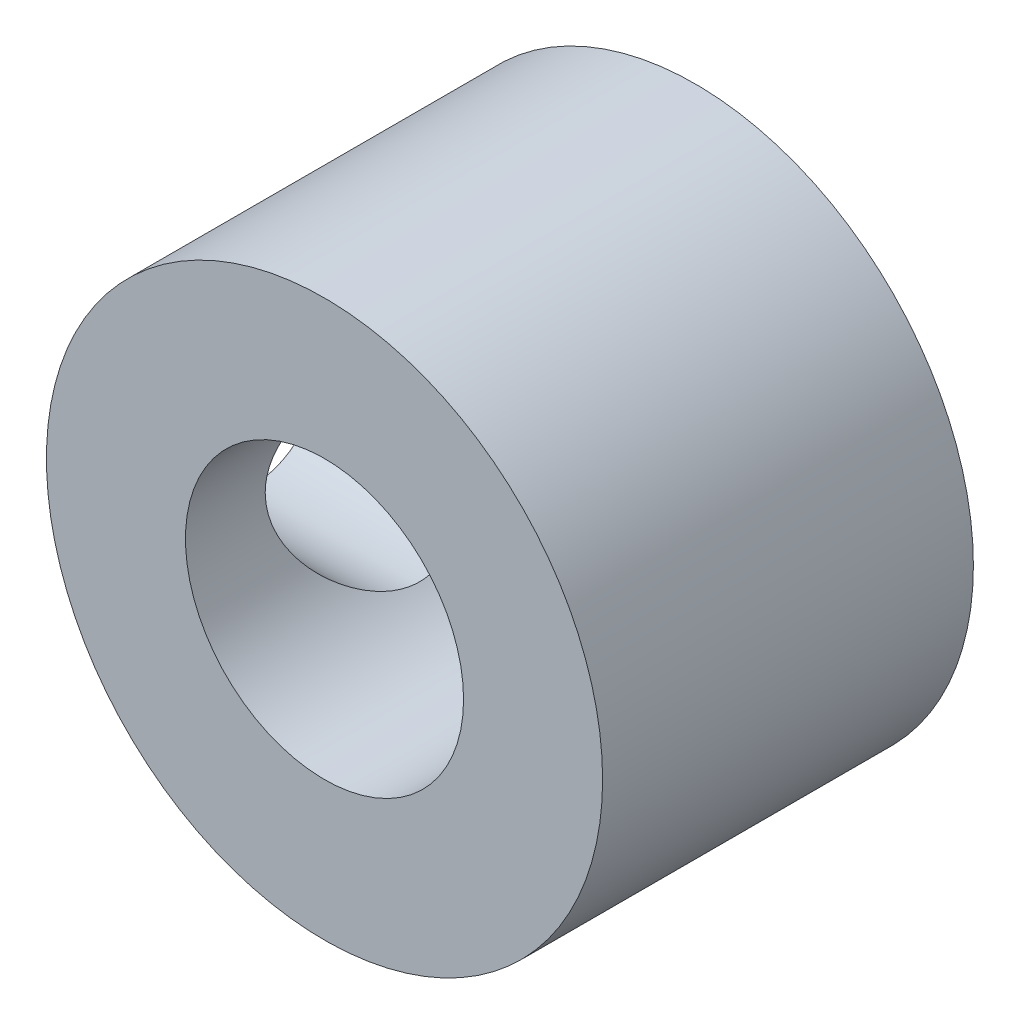
ISO-10303-21;
HEADER;
FILE_DESCRIPTION(('STEP AP214'),'2;1');
FILE_NAME('part.step','',(''),(''),'','','');
FILE_SCHEMA(('AUTOMOTIVE_DESIGN { 1 0 10303 214 1 1 1 1 }'));
ENDSEC;
DATA;
#1=APPLICATION_CONTEXT('core data for automotive mechanical design processes');
#2=APPLICATION_PROTOCOL_DEFINITION('international standard','automotive_design',2000,#1);
#3=PRODUCT_CONTEXT('',#1,'mechanical');
#4=PRODUCT('Part','Part','',(#3));
#5=PRODUCT_RELATED_PRODUCT_CATEGORY('part','',(#4));
#6=PRODUCT_DEFINITION_FORMATION('','',#4);
#7=PRODUCT_DEFINITION_CONTEXT('part definition',#1,'design');
#8=PRODUCT_DEFINITION('design','',#6,#7);
#9=PRODUCT_DEFINITION_SHAPE('','',#8);
#10=(LENGTH_UNIT() NAMED_UNIT(*) SI_UNIT(.MILLI.,.METRE.));
#11=(NAMED_UNIT(*) PLANE_ANGLE_UNIT() SI_UNIT($,.RADIAN.));
#12=(NAMED_UNIT(*) SI_UNIT($,.STERADIAN.) SOLID_ANGLE_UNIT());
#13=UNCERTAINTY_MEASURE_WITH_UNIT(LENGTH_MEASURE(1.E-05),#10,'distance_accuracy_value','');
#14=(GEOMETRIC_REPRESENTATION_CONTEXT(3) GLOBAL_UNCERTAINTY_ASSIGNED_CONTEXT((#13)) GLOBAL_UNIT_ASSIGNED_CONTEXT((#10,
#11,#12)) REPRESENTATION_CONTEXT('',''));
#15=CARTESIAN_POINT('',(0.,0.,0.));
#16=DIRECTION('',(0.,0.,1.));
#17=DIRECTION('',(1.,0.,0.));
#18=AXIS2_PLACEMENT_3D('',#15,#16,#17);
#19=CARTESIAN_POINT('',(0.,0.,8.46666666666667));
#20=DIRECTION('',(0.,0.,1.));
#21=DIRECTION('',(1.,0.,0.));
#22=AXIS2_PLACEMENT_3D('',#19,#20,#21);
#23=PLANE('',#22);
#24=CARTESIAN_POINT('',(0.,0.,8.46666666666667));
#25=DIRECTION('',(0.,0.,1.));
#26=DIRECTION('',(1.,0.,0.));
#27=AXIS2_PLACEMENT_3D('',#24,#25,#26);
#28=CIRCLE('',#27,6.35);
#29=CARTESIAN_POINT('',(6.35,0.,8.46666666666667));
#30=VERTEX_POINT('',#29);
#31=EDGE_CURVE('E10',#30,#30,#28,.T.);
#32=ORIENTED_EDGE('',*,*,#31,.T.);
#33=EDGE_LOOP('',(#32));
#34=FACE_BOUND('',#33,.T.);
#35=CARTESIAN_POINT('',(0.,0.,8.46666666666667));
#36=DIRECTION('',(0.,0.,1.));
#37=DIRECTION('',(1.,0.,0.));
#38=AXIS2_PLACEMENT_3D('',#35,#36,#37);
#39=CIRCLE('',#38,3.175);
#40=CARTESIAN_POINT('',(3.175,0.,8.46666666666667));
#41=VERTEX_POINT('',#40);
#42=EDGE_CURVE('E57',#41,#41,#39,.T.);
#43=ORIENTED_EDGE('',*,*,#42,.F.);
#44=EDGE_LOOP('',(#43));
#45=FACE_BOUND('',#44,.T.);
#46=ADVANCED_FACE('F38',(#34,#45),#23,.T.);
#47=CARTESIAN_POINT('',(0.,0.,0.));
#48=DIRECTION('',(0.,0.,1.));
#49=DIRECTION('',(1.,0.,0.));
#50=AXIS2_PLACEMENT_3D('',#47,#48,#49);
#51=PLANE('',#50);
#52=CARTESIAN_POINT('',(0.,0.,0.));
#53=DIRECTION('',(0.,0.,1.));
#54=DIRECTION('',(1.,0.,0.));
#55=AXIS2_PLACEMENT_3D('',#52,#53,#54);
#56=CIRCLE('',#55,6.35);
#57=CARTESIAN_POINT('',(6.35,0.,0.));
#58=VERTEX_POINT('',#57);
#59=EDGE_CURVE('E52',#58,#58,#56,.T.);
#60=ORIENTED_EDGE('',*,*,#59,.F.);
#61=EDGE_LOOP('',(#60));
#62=FACE_BOUND('',#61,.T.);
#63=CARTESIAN_POINT('',(0.,0.,0.));
#64=DIRECTION('',(0.,0.,1.));
#65=DIRECTION('',(1.,0.,0.));
#66=AXIS2_PLACEMENT_3D('',#63,#64,#65);
#67=CIRCLE('',#66,3.175);
#68=CARTESIAN_POINT('',(3.175,0.,0.));
#69=VERTEX_POINT('',#68);
#70=EDGE_CURVE('E59',#69,#69,#67,.T.);
#71=ORIENTED_EDGE('',*,*,#70,.T.);
#72=EDGE_LOOP('',(#71));
#73=FACE_BOUND('',#72,.T.);
#74=ADVANCED_FACE('F80',(#62,#73),#51,.F.);
#75=CARTESIAN_POINT('',(0.,0.,8.46666666666667));
#76=DIRECTION('',(0.,0.,-1.));
#77=DIRECTION('',(-1.,0.,0.));
#78=AXIS2_PLACEMENT_3D('',#75,#76,#77);
#79=CYLINDRICAL_SURFACE('',#78,6.35);
#80=CARTESIAN_POINT('',(-6.35,0.,1.82033333333333));
#81=CARTESIAN_POINT('',(-6.35000398969011,0.130555931467961,1.82032805798731));
#82=CARTESIAN_POINT('',(-6.34593890816647,0.261076241377738,1.83096187902202));
#83=CARTESIAN_POINT('',(-6.33012963929965,0.518209446534913,1.8730385365691));
#84=CARTESIAN_POINT('',(-6.31838678300935,0.644823015088654,1.90447776617555));
#85=CARTESIAN_POINT('',(-6.28848040494,0.890396734122701,1.98688821731258));
#86=CARTESIAN_POINT('',(-6.27032947705095,1.00937135935963,2.03782114394887));
#87=CARTESIAN_POINT('',(-6.22940932060409,1.23707694907278,2.15757568771399));
#88=CARTESIAN_POINT('',(-6.20663881943741,1.34580507871092,2.22640223568564));
#89=CARTESIAN_POINT('',(-6.15771932779737,1.5546544090621,2.3831105624072));
#90=CARTESIAN_POINT('',(-6.13147296383124,1.65427192875035,2.47163291708338));
#91=CARTESIAN_POINT('',(-6.07903240405007,1.83765571561736,2.66386018290428));
#92=CARTESIAN_POINT('',(-6.05283822744466,1.92141693988139,2.76756990568211));
#93=CARTESIAN_POINT('',(-6.00232668170519,2.07395660623911,2.99219946863209));
#94=CARTESIAN_POINT('',(-5.97812365120729,2.14201618015845,3.1136357717855));
#95=CARTESIAN_POINT('',(-5.93585432476053,2.25652093858858,3.36729495290098));
#96=CARTESIAN_POINT('',(-5.91778550353544,2.30297502037546,3.49951336431253));
#97=CARTESIAN_POINT('',(-5.89087364983883,2.37094947712185,3.7651797014353));
#98=CARTESIAN_POINT('',(-5.88167580744491,2.39343294050412,3.89834403253784));
#99=CARTESIAN_POINT('',(-5.87251090464605,2.41583880524757,4.16684873703971));
#100=CARTESIAN_POINT('',(-5.87253989940926,2.41577084821779,4.30218815575656));
#101=CARTESIAN_POINT('',(-5.88152011871453,2.39381090108878,4.56230556033634));
#102=CARTESIAN_POINT('',(-5.88992057372023,2.37326609797153,4.68721985589658));
#103=CARTESIAN_POINT('',(-5.91378008823147,2.31316652422954,4.93167303832416));
#104=CARTESIAN_POINT('',(-5.92924024008996,2.27360881167116,5.05121109017523));
#105=CARTESIAN_POINT('',(-5.96580146890692,2.17588364092748,5.28422494861853));
#106=CARTESIAN_POINT('',(-5.98700531598431,2.11737290423754,5.39753994817439));
#107=CARTESIAN_POINT('',(-6.03263175509448,1.98364217411328,5.6131297325392));
#108=CARTESIAN_POINT('',(-6.05705547794376,1.90841630395244,5.71540061560603));
#109=CARTESIAN_POINT('',(-6.10842961274997,1.73726689770536,5.91344027572196));
#110=CARTESIAN_POINT('',(-6.13543795015635,1.64027173491613,6.00827021593348));
#111=CARTESIAN_POINT('',(-6.18748920351012,1.43144868882472,6.18060139389734));
#112=CARTESIAN_POINT('',(-6.2125318005324,1.31961840653187,6.25809982351151));
#113=CARTESIAN_POINT('',(-6.25835188225341,1.08185265975391,6.39464104820616));
#114=CARTESIAN_POINT('',(-6.27905339803369,0.955717417234617,6.45336327644304));
#115=CARTESIAN_POINT('',(-6.31329326294077,0.694375189035108,6.54844069908559));
#116=CARTESIAN_POINT('',(-6.32683488218724,0.559172376611221,6.58480610569763));
#117=CARTESIAN_POINT('',(-6.3446501972992,0.291428150212525,6.63231443191051));
#118=CARTESIAN_POINT('',(-6.34938771868047,0.159141645079807,6.64472108622332));
#119=CARTESIAN_POINT('',(-6.35049981057155,-0.105693065348277,6.64764959681776));
#120=CARTESIAN_POINT('',(-6.34687629478166,-0.238241203822052,6.63817646101359));
#121=CARTESIAN_POINT('',(-6.33197908606406,-0.494323602805379,6.59856895715878));
#122=CARTESIAN_POINT('',(-6.32101461634214,-0.61800684441211,6.56926923152158));
#123=CARTESIAN_POINT('',(-6.29285092848222,-0.858609565436108,6.49194637709695));
#124=CARTESIAN_POINT('',(-6.27565090041604,-0.975528163914414,6.44392081597506));
#125=CARTESIAN_POINT('',(-6.23607457125026,-1.20317276582384,6.32896837047345));
#126=CARTESIAN_POINT('',(-6.21355984396609,-1.3136121499673,6.26152300943824));
#127=CARTESIAN_POINT('',(-6.16583504517286,-1.52197988578177,6.11022929216931));
#128=CARTESIAN_POINT('',(-6.14062396176678,-1.61990351002366,6.02637476798918));
#129=CARTESIAN_POINT('',(-6.08841217199752,-1.80656807112922,5.83876605829394));
#130=CARTESIAN_POINT('',(-6.06139435477813,-1.89441393314817,5.73412374315504));
#131=CARTESIAN_POINT('',(-6.01005496187559,-2.05148411432654,5.511061341446));
#132=CARTESIAN_POINT('',(-5.98573366426972,-2.12070651399853,5.39263983647958));
#133=CARTESIAN_POINT('',(-5.94261798623814,-2.23870023772464,5.14425608187193));
#134=CARTESIAN_POINT('',(-5.92385264334907,-2.28736466342468,5.01423766535671));
#135=CARTESIAN_POINT('',(-5.89458517077402,-2.36177800946808,4.74693602766531));
#136=CARTESIAN_POINT('',(-5.8840777409413,-2.38754162954713,4.60965752669691));
#137=CARTESIAN_POINT('',(-5.87323215610138,-2.41408994040532,4.34146049854871));
#138=CARTESIAN_POINT('',(-5.87227054588007,-2.41640623148607,4.21071759894922));
#139=CARTESIAN_POINT('',(-5.8790202253426,-2.3999373204655,3.95080845993678));
#140=CARTESIAN_POINT('',(-5.88673064582665,-2.38115423316032,3.82164206382208));
#141=CARTESIAN_POINT('',(-5.90943043237583,-2.32422421188573,3.57278106748399));
#142=CARTESIAN_POINT('',(-5.92417751295514,-2.28672002796391,3.45291541384166));
#143=CARTESIAN_POINT('',(-5.95914188552999,-2.193985281894,3.22111187714731));
#144=CARTESIAN_POINT('',(-5.97936057736356,-2.13875018285588,3.10917603208951));
#145=CARTESIAN_POINT('',(-6.02433337271119,-2.00869997639504,2.8899053275753));
#146=CARTESIAN_POINT('',(-6.04927206356278,-1.93299650808671,2.78313570916163));
#147=CARTESIAN_POINT('',(-6.10025417003155,-1.76551836882645,2.58332713966107));
#148=CARTESIAN_POINT('',(-6.12629793945648,-1.67373852090438,2.49029262943907));
#149=CARTESIAN_POINT('',(-6.17831294001547,-1.47055494697206,2.31526123381396));
#150=CARTESIAN_POINT('',(-6.20419794006484,-1.35833856072122,2.23417776691961));
#151=CARTESIAN_POINT('',(-6.25144642675378,-1.12096041375387,2.09203571258564));
#152=CARTESIAN_POINT('',(-6.27280935273315,-0.995797050693125,2.03097960768281));
#153=CARTESIAN_POINT('',(-6.30955475572144,-0.728778395788011,1.92834069717107));
#154=CARTESIAN_POINT('',(-6.32454657619379,-0.586384697783371,1.88800452809683));
#155=CARTESIAN_POINT('',(-6.34476431329028,-0.295976705251579,1.83401100451069));
#156=CARTESIAN_POINT('',(-6.34999547828747,-0.147965475024478,1.82033931214312));
#157=CARTESIAN_POINT('',(-6.35,0.,1.82033333333333));
#158=B_SPLINE_CURVE_WITH_KNOTS('',3,(#80,#81,#82,#83,#84,#85,#86,#87,#88,#89,#90,#91,#92,#93,
#94,#95,#96,#97,#98,#99,#100,#101,#102,#103,#104,#105,#106,#107,#108,#109,#110,#111,#112,#113,
#114,#115,#116,#117,#118,#119,#120,#121,#122,#123,#124,#125,#126,#127,#128,#129,#130,#131,#132,
#133,#134,#135,#136,#137,#138,#139,#140,#141,#142,#143,#144,#145,#146,#147,#148,#149,#150,#151,
#152,#153,#154,#155,#156,#157),.UNSPECIFIED.,.T.,.F.,(4,2,2,2,2,2,2,2,2,2,2,2,2,2,2,2,2,2,2,2,2,
2,2,2,2,2,2,2,2,2,2,2,2,2,2,2,2,2,4),(0.,0.391121887064185,0.782175985486185,1.17246577830223,
1.56286323524963,1.96854634212709,2.37435825594016,2.79613130529395,3.21773051175688,
3.62166628723491,4.02542936468621,4.40427313209371,4.78317553819666,5.16936515238192,
5.55569075901495,5.96873424705112,6.38184461005431,6.80167192308661,7.22130732355892,
7.61812936188612,8.01486058335589,8.39585156202364,8.77689204483065,9.16923685275,
9.56172942118013,9.9776135359701,10.3935404987953,10.8116043631128,11.2293996833676,
11.6197130905881,12.0099873800853,12.3876994067832,12.7655081575183,13.1635000328781,
13.5616203073395,13.9821012344605,14.4026342635628,14.8461505355472,15.2894282569131),.UNSPECIFIED.);
#159=CARTESIAN_POINT('',(-6.35,0.,1.82033333333333));
#160=VERTEX_POINT('',#159);
#161=EDGE_CURVE('E62',#160,#160,#158,.T.);
#162=ORIENTED_EDGE('',*,*,#161,.T.);
#163=EDGE_LOOP('',(#162));
#164=FACE_BOUND('',#163,.T.);
#165=ORIENTED_EDGE('',*,*,#31,.F.);
#166=EDGE_LOOP('',(#165));
#167=FACE_BOUND('',#166,.T.);
#168=ORIENTED_EDGE('',*,*,#59,.T.);
#169=EDGE_LOOP('',(#168));
#170=FACE_BOUND('',#169,.T.);
#171=ADVANCED_FACE('F40',(#164,#167,#170),#79,.T.);
#172=CARTESIAN_POINT('',(0.,0.,8.46666666666667));
#173=DIRECTION('',(0.,0.,-1.));
#174=DIRECTION('',(-1.,0.,0.));
#175=AXIS2_PLACEMENT_3D('',#172,#173,#174);
#176=CYLINDRICAL_SURFACE('',#175,3.175);
#177=CARTESIAN_POINT('',(-3.175,0.,6.64633333333333));
#178=CARTESIAN_POINT('',(-3.17499092904906,-0.117443171605231,6.6463239136524));
#179=CARTESIAN_POINT('',(-3.16841692674332,-0.23503818841931,6.63769151806024));
#180=CARTESIAN_POINT('',(-3.14271336140829,-0.466484967913332,6.60371508791115));
#181=CARTESIAN_POINT('',(-3.12355818632314,-0.580328596183407,6.57833696283427));
#182=CARTESIAN_POINT('',(-3.07452724978738,-0.80033693546367,6.51261765964589));
#183=CARTESIAN_POINT('',(-3.04471549355358,-0.906543039514099,6.47236576821307));
#184=CARTESIAN_POINT('',(-2.97659455342082,-1.10997011785933,6.37881349172543));
#185=CARTESIAN_POINT('',(-2.93828675533249,-1.20719255384311,6.32551523454912));
#186=CARTESIAN_POINT('',(-2.85170030734834,-1.40022726688529,6.2021541864088));
#187=CARTESIAN_POINT('',(-2.80282512985173,-1.49506365463583,6.13099191455835));
#188=CARTESIAN_POINT('',(-2.7008760546092,-1.67223382567996,5.97689744915093));
#189=CARTESIAN_POINT('',(-2.64779595363648,-1.75454859398162,5.89394771771647));
#190=CARTESIAN_POINT('',(-2.5296135351956,-1.92203888294129,5.69899192574171));
#191=CARTESIAN_POINT('',(-2.4643124367144,-2.00423140536036,5.58453381800432));
#192=CARTESIAN_POINT('',(-2.33951215894306,-2.14857118710811,5.3406906997819));
#193=CARTESIAN_POINT('',(-2.28000569136513,-2.21074385995913,5.21132489905116));
#194=CARTESIAN_POINT('',(-2.19490180220151,-2.29462037317499,4.9858306419419));
#195=CARTESIAN_POINT('',(-2.16472241167551,-2.32287346332998,4.8938916124056));
#196=CARTESIAN_POINT('',(-2.11470881226284,-2.36849823013454,4.70472372033593));
#197=CARTESIAN_POINT('',(-2.09485053921884,-2.38589523743028,4.60750775158838));
#198=CARTESIAN_POINT('',(-2.06860028206587,-2.40870358471578,4.40879381011061));
#199=CARTESIAN_POINT('',(-2.06234200752845,-2.4139959431512,4.30726323906503));
#200=CARTESIAN_POINT('',(-2.06503422028968,-2.41169213967819,4.10453514853261));
#201=CARTESIAN_POINT('',(-2.07398814667792,-2.40409306334661,4.0033377095408));
#202=CARTESIAN_POINT('',(-2.10340433920656,-2.37836508518799,3.81641608719869));
#203=CARTESIAN_POINT('',(-2.1224091464969,-2.36156171265492,3.73025990377309));
#204=CARTESIAN_POINT('',(-2.16837457604816,-2.31942910669347,3.5622683703591));
#205=CARTESIAN_POINT('',(-2.19534332114491,-2.29409116468348,3.4804375329785));
#206=CARTESIAN_POINT('',(-2.27376916611903,-2.21702947004233,3.27070165304359));
#207=CARTESIAN_POINT('',(-2.32983777456744,-2.15880606368403,3.14691249359326));
#208=CARTESIAN_POINT('',(-2.44783368287626,-2.02405846701681,2.91269776597149));
#209=CARTESIAN_POINT('',(-2.50977535205404,-1.94748865288627,2.80230656352978));
#210=CARTESIAN_POINT('',(-2.63500191833981,-1.77457755480707,2.5924693280671));
#211=CARTESIAN_POINT('',(-2.69827393808611,-1.67772908569284,2.4934315185507));
#212=CARTESIAN_POINT('',(-2.81868720555883,-1.46641465679805,2.31200088539084));
#213=CARTESIAN_POINT('',(-2.87583967861316,-1.35198192561174,2.2295773315382));
#214=CARTESIAN_POINT('',(-2.96897239724257,-1.1302184691796,2.09828412356896));
#215=CARTESIAN_POINT('',(-3.00691100546587,-1.02573469648465,2.04601099534738));
#216=CARTESIAN_POINT('',(-3.07269924184988,-0.807524498934967,1.95641589790982));
#217=CARTESIAN_POINT('',(-3.10055488265641,-0.693803632023795,1.91908501696658));
#218=CARTESIAN_POINT('',(-3.14392869528766,-0.458986561176875,1.86128767751164));
#219=CARTESIAN_POINT('',(-3.15936426972399,-0.337846653718271,1.84093409116866));
#220=CARTESIAN_POINT('',(-3.17600778354888,-0.0929212408274521,1.8189961516629));
#221=CARTESIAN_POINT('',(-3.17722319336241,0.0308628412677081,1.81740194344102));
#222=CARTESIAN_POINT('',(-3.16598164725166,0.263113673769305,1.83220903119381));
#223=CARTESIAN_POINT('',(-3.15499411480433,0.371784896474089,1.84667621394949));
#224=CARTESIAN_POINT('',(-3.12256258934286,0.584657379974263,1.88971623513884));
#225=CARTESIAN_POINT('',(-3.10111659842469,0.688857782558673,1.91829176873709));
#226=CARTESIAN_POINT('',(-3.04866013703249,0.893151752270641,1.98904048872195));
#227=CARTESIAN_POINT('',(-3.01741404656932,0.993066473951874,2.03154996271589));
#228=CARTESIAN_POINT('',(-2.94762615076737,1.18427030490273,2.12820591356904));
#229=CARTESIAN_POINT('',(-2.90908324556455,1.27555811070553,2.18235414492909));
#230=CARTESIAN_POINT('',(-2.82008518778891,1.4629408219305,2.31049839996112));
#231=CARTESIAN_POINT('',(-2.76871323654288,1.55736336530954,2.38629354036201));
#232=CARTESIAN_POINT('',(-2.66229345480278,1.7330266340156,2.54998932524836));
#233=CARTESIAN_POINT('',(-2.60723836781931,1.81424018707203,2.63791425249989));
#234=CARTESIAN_POINT('',(-2.51929011373857,1.93310120506621,2.78737105523686));
#235=CARTESIAN_POINT('',(-2.48634042838264,1.97518148865632,2.84539329623462));
#236=CARTESIAN_POINT('',(-2.42143291492003,2.05424288960517,2.96533376535887));
#237=CARTESIAN_POINT('',(-2.38947544500995,2.09122218168265,3.02725337659404));
#238=CARTESIAN_POINT('',(-2.29677780916441,2.19405069763864,3.21862411819679));
#239=CARTESIAN_POINT('',(-2.2389759481709,2.25209423008379,3.35406566289992));
#240=CARTESIAN_POINT('',(-2.16148731453314,2.32600727289693,3.58466571521376));
#241=CARTESIAN_POINT('',(-2.13568591161393,2.34951337659766,3.67533820565917));
#242=CARTESIAN_POINT('',(-2.09487284834006,2.38597736286025,3.86105773052054));
#243=CARTESIAN_POINT('',(-2.07983544919009,2.39896041795918,3.95609374735179));
#244=CARTESIAN_POINT('',(-2.06298898322372,2.41347202601588,4.14895132902947));
#245=CARTESIAN_POINT('',(-2.06127434940024,2.41491881071071,4.24678785416626));
#246=CARTESIAN_POINT('',(-2.07166816759276,2.40600289841214,4.44121546981467));
#247=CARTESIAN_POINT('',(-2.08379036100337,2.39562846174622,4.53780522574479));
#248=CARTESIAN_POINT('',(-2.12256830664757,2.36137219311358,4.74216770098945));
#249=CARTESIAN_POINT('',(-2.15126142901359,2.33557340769404,4.84921513150579));
#250=CARTESIAN_POINT('',(-2.21923176610734,2.27108364148613,5.05584894706376));
#251=CARTESIAN_POINT('',(-2.25853638265595,2.2323592210675,5.15541515046379));
#252=CARTESIAN_POINT('',(-2.35955877527054,2.12610942507655,5.38386643027093));
#253=CARTESIAN_POINT('',(-2.42403799567887,2.05324191025265,5.50903331597376));
#254=CARTESIAN_POINT('',(-2.55539518076956,1.88728411653423,5.74376519302583));
#255=CARTESIAN_POINT('',(-2.62227580852244,1.79417076882036,5.8533121487529));
#256=CARTESIAN_POINT('',(-2.75272337581286,1.58693666845894,6.056956206491));
#257=CARTESIAN_POINT('',(-2.81622750409905,1.47252844795802,6.15080376963204));
#258=CARTESIAN_POINT('',(-2.93245405690648,1.22472214874906,6.31775192179273));
#259=CARTESIAN_POINT('',(-2.9852011492147,1.09136873492959,6.39090013099522));
#260=CARTESIAN_POINT('',(-3.06143310070406,0.848324156263043,6.49500958428414));
#261=CARTESIAN_POINT('',(-3.08897584082985,0.742491250018576,6.53204902527986));
#262=CARTESIAN_POINT('',(-3.13329848559572,0.524711420429955,6.59127671661092));
#263=CARTESIAN_POINT('',(-3.1501052759874,0.412780537897339,6.61350207158471));
#264=CARTESIAN_POINT('',(-3.16554486424948,0.249887399880882,6.63388122008719));
#265=CARTESIAN_POINT('',(-3.16908209053624,0.200104041382905,6.63854217535146));
#266=CARTESIAN_POINT('',(-3.17381185752955,0.10022305414221,6.64477058961822));
#267=CARTESIAN_POINT('',(-3.17500387152911,0.0501253573366514,6.64633735370222));
#268=CARTESIAN_POINT('',(-3.175,0.,6.64633333333333));
#269=B_SPLINE_CURVE_WITH_KNOTS('',3,(#177,#178,#179,#180,#181,#182,#183,#184,#185,#186,#187,
#188,#189,#190,#191,#192,#193,#194,#195,#196,#197,#198,#199,#200,#201,#202,#203,#204,#205,#206,
#207,#208,#209,#210,#211,#212,#213,#214,#215,#216,#217,#218,#219,#220,#221,#222,#223,#224,#225,
#226,#227,#228,#229,#230,#231,#232,#233,#234,#235,#236,#237,#238,#239,#240,#241,#242,#243,#244,
#245,#246,#247,#248,#249,#250,#251,#252,#253,#254,#255,#256,#257,#258,#259,#260,#261,#262,#263,
#264,#265,#266,#267,#268),.UNSPECIFIED.,.T.,.F.,(4,2,2,2,2,2,2,2,2,2,2,2,2,2,2,2,2,2,2,2,2,2,2,
2,2,2,2,2,2,2,2,2,2,2,2,2,2,2,2,2,2,2,2,2,2,4),(0.,0.352113770291782,0.704946585369682,
1.05569488379078,1.40638601280107,1.78976092813112,2.17371233600607,2.63773050853704,
3.10115730525324,3.40258553658297,3.70330778533679,4.00697348207613,4.31070783899934,
4.57916413533347,4.84789519559245,5.28900480236595,5.73122295780719,6.18621377116464,
6.64035513804427,7.00739894320242,7.37422351187942,7.74346787257931,8.11251824563582,
8.44151894934109,8.77058252746343,9.10825790412116,9.44598421987269,9.83917081589854,
10.2331562784928,10.469557715449,10.7060435254033,11.1774135342105,11.4679029980311,
11.757695504225,12.0495402292483,12.3416750384965,12.6811651199407,13.0215403855346,
13.4947220530831,13.9684457327182,14.4491015240246,14.9286423754469,15.2736416515379,
15.6177735325977,15.768023783139,15.9183077742625),.UNSPECIFIED.);
#270=CARTESIAN_POINT('',(-3.175,0.,6.64633333333333));
#271=VERTEX_POINT('',#270);
#272=EDGE_CURVE('E43',#271,#271,#269,.T.);
#273=ORIENTED_EDGE('',*,*,#272,.F.);
#274=EDGE_LOOP('',(#273));
#275=FACE_BOUND('',#274,.T.);
#276=ORIENTED_EDGE('',*,*,#42,.T.);
#277=EDGE_LOOP('',(#276));
#278=FACE_BOUND('',#277,.T.);
#279=ORIENTED_EDGE('',*,*,#70,.F.);
#280=EDGE_LOOP('',(#279));
#281=FACE_BOUND('',#280,.T.);
#282=ADVANCED_FACE('F72',(#275,#278,#281),#176,.F.);
#283=CARTESIAN_POINT('',(-6.35,0.,4.23333333333333));
#284=DIRECTION('',(1.,0.,0.));
#285=DIRECTION('',(0.,0.,-1.));
#286=AXIS2_PLACEMENT_3D('',#283,#284,#285);
#287=CYLINDRICAL_SURFACE('',#286,2.413);
#288=ORIENTED_EDGE('',*,*,#272,.T.);
#289=EDGE_LOOP('',(#288));
#290=FACE_BOUND('',#289,.T.);
#291=ORIENTED_EDGE('',*,*,#161,.F.);
#292=EDGE_LOOP('',(#291));
#293=FACE_BOUND('',#292,.T.);
#294=ADVANCED_FACE('F69',(#290,#293),#287,.F.);
#295=CLOSED_SHELL('',(#46,#74,#171,#282,#294));
#296=MANIFOLD_SOLID_BREP('B2',#295);
#297=ADVANCED_BREP_SHAPE_REPRESENTATION('',(#18,#296),#14);
#298=SHAPE_DEFINITION_REPRESENTATION(#9,#297);
ENDSEC;
END-ISO-10303-21;
